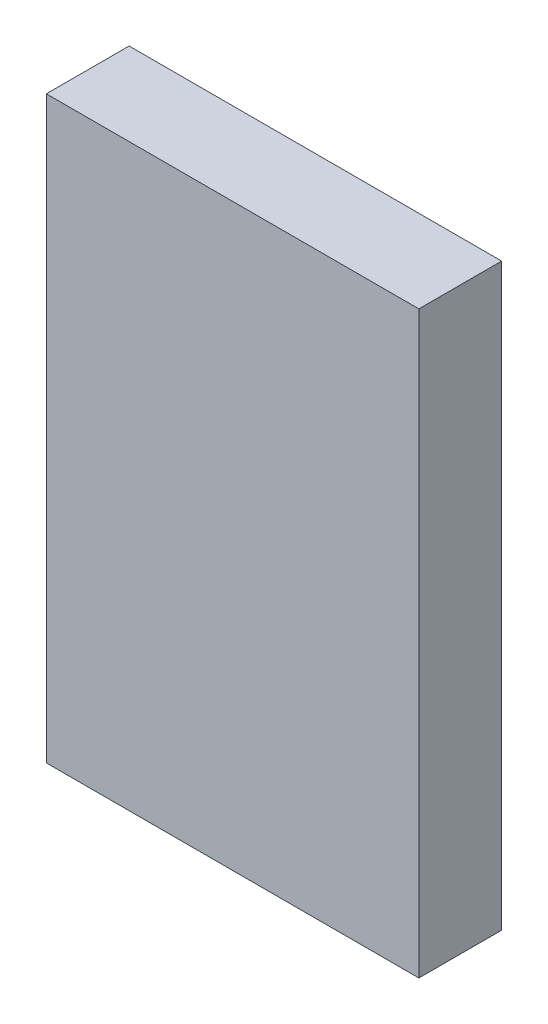
ISO-10303-21;
HEADER;
FILE_DESCRIPTION(('STEP AP214'),'2;1');
FILE_NAME('part.step','',(''),(''),'','','');
FILE_SCHEMA(('AUTOMOTIVE_DESIGN { 1 0 10303 214 1 1 1 1 }'));
ENDSEC;
DATA;
#1=APPLICATION_CONTEXT('core data for automotive mechanical design processes');
#2=APPLICATION_PROTOCOL_DEFINITION('international standard','automotive_design',2000,#1);
#3=PRODUCT_CONTEXT('',#1,'mechanical');
#4=PRODUCT('Part','Part','',(#3));
#5=PRODUCT_RELATED_PRODUCT_CATEGORY('part','',(#4));
#6=PRODUCT_DEFINITION_FORMATION('','',#4);
#7=PRODUCT_DEFINITION_CONTEXT('part definition',#1,'design');
#8=PRODUCT_DEFINITION('design','',#6,#7);
#9=PRODUCT_DEFINITION_SHAPE('','',#8);
#10=(LENGTH_UNIT() NAMED_UNIT(*) SI_UNIT(.MILLI.,.METRE.));
#11=(NAMED_UNIT(*) PLANE_ANGLE_UNIT() SI_UNIT($,.RADIAN.));
#12=(NAMED_UNIT(*) SI_UNIT($,.STERADIAN.) SOLID_ANGLE_UNIT());
#13=UNCERTAINTY_MEASURE_WITH_UNIT(LENGTH_MEASURE(1.E-05),#10,'distance_accuracy_value','');
#14=(GEOMETRIC_REPRESENTATION_CONTEXT(3) GLOBAL_UNCERTAINTY_ASSIGNED_CONTEXT((#13)) GLOBAL_UNIT_ASSIGNED_CONTEXT((#10,
#11,#12)) REPRESENTATION_CONTEXT('',''));
#15=CARTESIAN_POINT('',(0.,0.,0.));
#16=DIRECTION('',(0.,0.,1.));
#17=DIRECTION('',(1.,0.,0.));
#18=AXIS2_PLACEMENT_3D('',#15,#16,#17);
#19=CARTESIAN_POINT('',(0.,0.,0.2999994));
#20=DIRECTION('',(0.,0.,-1.));
#21=DIRECTION('',(-1.,0.,0.));
#22=AXIS2_PLACEMENT_3D('',#19,#20,#21);
#23=PLANE('',#22);
#24=DIRECTION('',(1.,0.,0.));
#25=VECTOR('',#24,1.);
#26=CARTESIAN_POINT('',(0.67499992,-1.05000044,0.2999994));
#27=LINE('',#26,#25);
#28=CARTESIAN_POINT('',(0.67499992,-1.05000044,0.2999994));
#29=VERTEX_POINT('',#28);
#30=CARTESIAN_POINT('',(-0.67499992,-1.05000044,0.2999994));
#31=VERTEX_POINT('',#30);
#32=EDGE_CURVE('E68',#29,#31,#27,.F.);
#33=ORIENTED_EDGE('',*,*,#32,.F.);
#34=DIRECTION('',(0.,1.,0.));
#35=VECTOR('',#34,1.);
#36=CARTESIAN_POINT('',(0.67499992,1.05000044,0.2999994));
#37=LINE('',#36,#35);
#38=CARTESIAN_POINT('',(0.67499992,1.05000044,0.2999994));
#39=VERTEX_POINT('',#38);
#40=EDGE_CURVE('E55',#39,#29,#37,.F.);
#41=ORIENTED_EDGE('',*,*,#40,.F.);
#42=DIRECTION('',(1.,0.,0.));
#43=VECTOR('',#42,1.);
#44=CARTESIAN_POINT('',(-0.67499992,1.05000044,0.2999994));
#45=LINE('',#44,#43);
#46=CARTESIAN_POINT('',(-0.67499992,1.05000044,0.2999994));
#47=VERTEX_POINT('',#46);
#48=EDGE_CURVE('E20',#47,#39,#45,.T.);
#49=ORIENTED_EDGE('',*,*,#48,.F.);
#50=DIRECTION('',(0.,1.,0.));
#51=VECTOR('',#50,1.);
#52=CARTESIAN_POINT('',(-0.67499992,-1.05000044,0.2999994));
#53=LINE('',#52,#51);
#54=EDGE_CURVE('E80',#31,#47,#53,.T.);
#55=ORIENTED_EDGE('',*,*,#54,.F.);
#56=EDGE_LOOP('',(#33,#41,#49,#55));
#57=FACE_BOUND('',#56,.T.);
#58=ADVANCED_FACE('F17',(#57),#23,.F.);
#59=CARTESIAN_POINT('',(-0.67499992,1.05000044,0.));
#60=DIRECTION('',(0.,1.,0.));
#61=DIRECTION('',(0.,0.,1.));
#62=AXIS2_PLACEMENT_3D('',#59,#60,#61);
#63=PLANE('',#62);
#64=DIRECTION('',(0.,0.,-1.));
#65=VECTOR('',#64,1.);
#66=CARTESIAN_POINT('',(0.67499992,1.05000044,0.));
#67=LINE('',#66,#65);
#68=CARTESIAN_POINT('',(0.67499992,1.05000044,0.));
#69=VERTEX_POINT('',#68);
#70=EDGE_CURVE('E61',#69,#39,#67,.F.);
#71=ORIENTED_EDGE('',*,*,#70,.F.);
#72=DIRECTION('',(-1.,0.,0.));
#73=VECTOR('',#72,1.);
#74=CARTESIAN_POINT('',(0.,1.05000044,0.));
#75=LINE('',#74,#73);
#76=CARTESIAN_POINT('',(-0.67499992,1.05000044,0.));
#77=VERTEX_POINT('',#76);
#78=EDGE_CURVE('E83',#77,#69,#75,.F.);
#79=ORIENTED_EDGE('',*,*,#78,.F.);
#80=DIRECTION('',(0.,0.,1.));
#81=VECTOR('',#80,1.);
#82=CARTESIAN_POINT('',(-0.67499992,1.05000044,0.));
#83=LINE('',#82,#81);
#84=EDGE_CURVE('E64',#47,#77,#83,.F.);
#85=ORIENTED_EDGE('',*,*,#84,.F.);
#86=ORIENTED_EDGE('',*,*,#48,.T.);
#87=EDGE_LOOP('',(#71,#79,#85,#86));
#88=FACE_BOUND('',#87,.T.);
#89=ADVANCED_FACE('F60',(#88),#63,.T.);
#90=CARTESIAN_POINT('',(0.67499992,1.05000044,0.));
#91=DIRECTION('',(1.,0.,0.));
#92=DIRECTION('',(0.,0.,-1.));
#93=AXIS2_PLACEMENT_3D('',#90,#91,#92);
#94=PLANE('',#93);
#95=DIRECTION('',(0.,0.,-1.));
#96=VECTOR('',#95,1.);
#97=CARTESIAN_POINT('',(0.67499992,-1.05000044,0.));
#98=LINE('',#97,#96);
#99=CARTESIAN_POINT('',(0.67499992,-1.05000044,0.));
#100=VERTEX_POINT('',#99);
#101=EDGE_CURVE('E70',#100,#29,#98,.F.);
#102=ORIENTED_EDGE('',*,*,#101,.F.);
#103=DIRECTION('',(0.,1.,0.));
#104=VECTOR('',#103,1.);
#105=CARTESIAN_POINT('',(0.67499992,0.,0.));
#106=LINE('',#105,#104);
#107=EDGE_CURVE('E74',#69,#100,#106,.F.);
#108=ORIENTED_EDGE('',*,*,#107,.F.);
#109=ORIENTED_EDGE('',*,*,#70,.T.);
#110=ORIENTED_EDGE('',*,*,#40,.T.);
#111=EDGE_LOOP('',(#102,#108,#109,#110));
#112=FACE_BOUND('',#111,.T.);
#113=ADVANCED_FACE('F72',(#112),#94,.T.);
#114=CARTESIAN_POINT('',(0.67499992,-1.05000044,0.));
#115=DIRECTION('',(0.,-1.,0.));
#116=DIRECTION('',(0.,0.,-1.));
#117=AXIS2_PLACEMENT_3D('',#114,#115,#116);
#118=PLANE('',#117);
#119=DIRECTION('',(0.,0.,1.));
#120=VECTOR('',#119,1.);
#121=CARTESIAN_POINT('',(-0.67499992,-1.05000044,0.));
#122=LINE('',#121,#120);
#123=CARTESIAN_POINT('',(-0.67499992,-1.05000044,0.));
#124=VERTEX_POINT('',#123);
#125=EDGE_CURVE('E35',#124,#31,#122,.T.);
#126=ORIENTED_EDGE('',*,*,#125,.F.);
#127=DIRECTION('',(-1.,0.,0.));
#128=VECTOR('',#127,1.);
#129=CARTESIAN_POINT('',(0.,-1.05000044,0.));
#130=LINE('',#129,#128);
#131=EDGE_CURVE('E26',#100,#124,#130,.T.);
#132=ORIENTED_EDGE('',*,*,#131,.F.);
#133=ORIENTED_EDGE('',*,*,#101,.T.);
#134=ORIENTED_EDGE('',*,*,#32,.T.);
#135=EDGE_LOOP('',(#126,#132,#133,#134));
#136=FACE_BOUND('',#135,.T.);
#137=ADVANCED_FACE('F89',(#136),#118,.T.);
#138=CARTESIAN_POINT('',(-0.67499992,-1.05000044,0.));
#139=DIRECTION('',(-1.,0.,0.));
#140=DIRECTION('',(0.,0.,1.));
#141=AXIS2_PLACEMENT_3D('',#138,#139,#140);
#142=PLANE('',#141);
#143=ORIENTED_EDGE('',*,*,#84,.T.);
#144=DIRECTION('',(0.,1.,0.));
#145=VECTOR('',#144,1.);
#146=CARTESIAN_POINT('',(-0.67499992,0.,0.));
#147=LINE('',#146,#145);
#148=EDGE_CURVE('E11',#124,#77,#147,.T.);
#149=ORIENTED_EDGE('',*,*,#148,.F.);
#150=ORIENTED_EDGE('',*,*,#125,.T.);
#151=ORIENTED_EDGE('',*,*,#54,.T.);
#152=EDGE_LOOP('',(#143,#149,#150,#151));
#153=FACE_BOUND('',#152,.T.);
#154=ADVANCED_FACE('F91',(#153),#142,.T.);
#155=CARTESIAN_POINT('',(0.,0.,0.));
#156=DIRECTION('',(0.,0.,-1.));
#157=DIRECTION('',(-1.,0.,0.));
#158=AXIS2_PLACEMENT_3D('',#155,#156,#157);
#159=PLANE('',#158);
#160=ORIENTED_EDGE('',*,*,#131,.T.);
#161=ORIENTED_EDGE('',*,*,#148,.T.);
#162=ORIENTED_EDGE('',*,*,#78,.T.);
#163=ORIENTED_EDGE('',*,*,#107,.T.);
#164=EDGE_LOOP('',(#160,#161,#162,#163));
#165=FACE_BOUND('',#164,.T.);
#166=ADVANCED_FACE('F88',(#165),#159,.T.);
#167=CLOSED_SHELL('',(#58,#89,#113,#137,#154,#166));
#168=MANIFOLD_SOLID_BREP('B1',#167);
#169=ADVANCED_BREP_SHAPE_REPRESENTATION('',(#18,#168),#14);
#170=SHAPE_DEFINITION_REPRESENTATION(#9,#169);
ENDSEC;
END-ISO-10303-21;
